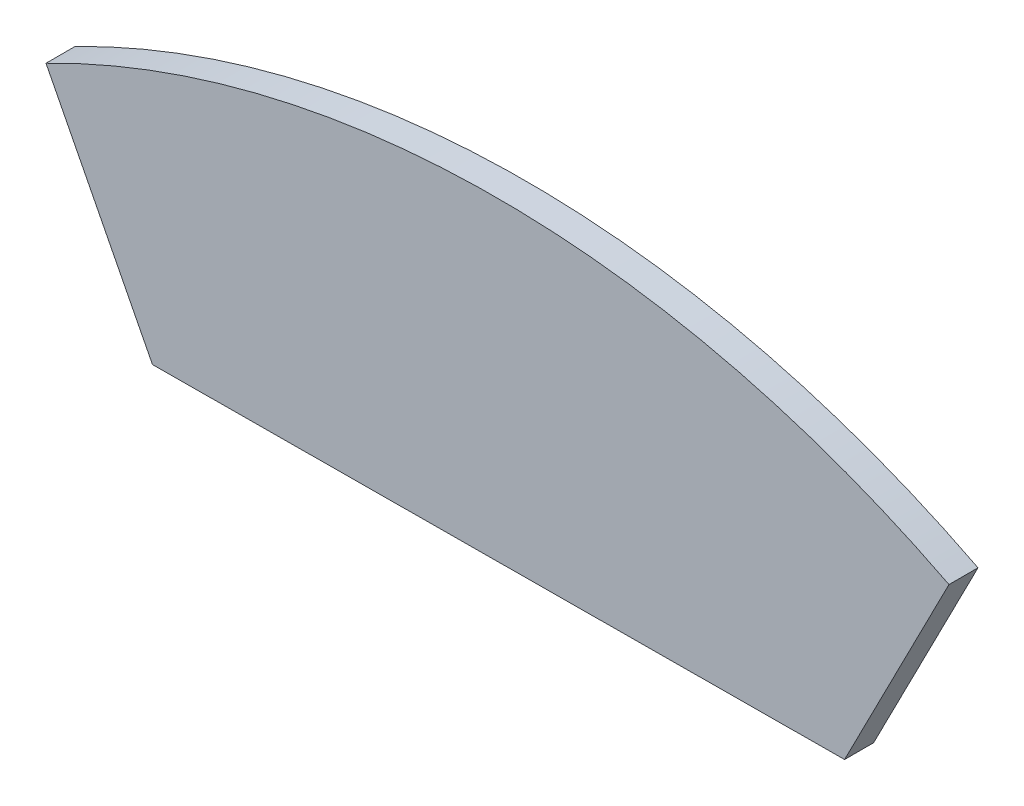
ISO-10303-21;
HEADER;
FILE_DESCRIPTION(('STEP AP214'),'2;1');
FILE_NAME('part.step','',(''),(''),'','','');
FILE_SCHEMA(('AUTOMOTIVE_DESIGN { 1 0 10303 214 1 1 1 1 }'));
ENDSEC;
DATA;
#1=APPLICATION_CONTEXT('core data for automotive mechanical design processes');
#2=APPLICATION_PROTOCOL_DEFINITION('international standard','automotive_design',2000,#1);
#3=PRODUCT_CONTEXT('',#1,'mechanical');
#4=PRODUCT('Part','Part','',(#3));
#5=PRODUCT_RELATED_PRODUCT_CATEGORY('part','',(#4));
#6=PRODUCT_DEFINITION_FORMATION('','',#4);
#7=PRODUCT_DEFINITION_CONTEXT('part definition',#1,'design');
#8=PRODUCT_DEFINITION('design','',#6,#7);
#9=PRODUCT_DEFINITION_SHAPE('','',#8);
#10=(LENGTH_UNIT() NAMED_UNIT(*) SI_UNIT(.MILLI.,.METRE.));
#11=(NAMED_UNIT(*) PLANE_ANGLE_UNIT() SI_UNIT($,.RADIAN.));
#12=(NAMED_UNIT(*) SI_UNIT($,.STERADIAN.) SOLID_ANGLE_UNIT());
#13=UNCERTAINTY_MEASURE_WITH_UNIT(LENGTH_MEASURE(1.E-05),#10,'distance_accuracy_value','');
#14=(GEOMETRIC_REPRESENTATION_CONTEXT(3) GLOBAL_UNCERTAINTY_ASSIGNED_CONTEXT((#13)) GLOBAL_UNIT_ASSIGNED_CONTEXT((#10,
#11,#12)) REPRESENTATION_CONTEXT('',''));
#15=CARTESIAN_POINT('',(0.,0.,0.));
#16=DIRECTION('',(0.,0.,1.));
#17=DIRECTION('',(1.,0.,0.));
#18=AXIS2_PLACEMENT_3D('',#15,#16,#17);
#19=CARTESIAN_POINT('',(0.,0.,3.175));
#20=DIRECTION('',(0.,0.,-1.));
#21=DIRECTION('',(-1.,0.,0.));
#22=AXIS2_PLACEMENT_3D('',#19,#20,#21);
#23=CYLINDRICAL_SURFACE('',#22,108.276621199646);
#24=CARTESIAN_POINT('',(0.,0.,0.));
#25=DIRECTION('',(0.,0.,1.));
#26=DIRECTION('',(1.,0.,0.));
#27=AXIS2_PLACEMENT_3D('',#24,#25,#26);
#28=CIRCLE('',#27,108.276621199646);
#29=CARTESIAN_POINT('',(49.3808428011907,96.3605679863698,0.));
#30=VERTEX_POINT('',#29);
#31=CARTESIAN_POINT('',(-49.3808428011907,96.3605679863698,0.));
#32=VERTEX_POINT('',#31);
#33=EDGE_CURVE('E94',#30,#32,#28,.T.);
#34=ORIENTED_EDGE('',*,*,#33,.T.);
#35=DIRECTION('',(0.,0.,-1.));
#36=VECTOR('',#35,1.);
#37=CARTESIAN_POINT('',(-49.3808428011907,96.3605679863698,3.175));
#38=LINE('',#37,#36);
#39=CARTESIAN_POINT('',(-49.3808428011907,96.3605679863698,3.175));
#40=VERTEX_POINT('',#39);
#41=EDGE_CURVE('E11',#40,#32,#38,.T.);
#42=ORIENTED_EDGE('',*,*,#41,.F.);
#43=CARTESIAN_POINT('',(0.,0.,3.175));
#44=DIRECTION('',(0.,0.,1.));
#45=DIRECTION('',(1.,0.,0.));
#46=AXIS2_PLACEMENT_3D('',#43,#44,#45);
#47=CIRCLE('',#46,108.276621199646);
#48=CARTESIAN_POINT('',(49.3808428011907,96.3605679863698,3.175));
#49=VERTEX_POINT('',#48);
#50=EDGE_CURVE('E82',#49,#40,#47,.T.);
#51=ORIENTED_EDGE('',*,*,#50,.F.);
#52=DIRECTION('',(0.,0.,-1.));
#53=VECTOR('',#52,1.);
#54=CARTESIAN_POINT('',(49.3808428011907,96.3605679863698,3.175));
#55=LINE('',#54,#53);
#56=EDGE_CURVE('E90',#49,#30,#55,.T.);
#57=ORIENTED_EDGE('',*,*,#56,.T.);
#58=EDGE_LOOP('',(#34,#42,#51,#57));
#59=FACE_BOUND('',#58,.T.);
#60=ADVANCED_FACE('F31',(#59),#23,.T.);
#61=CARTESIAN_POINT('',(-49.3808428011907,96.3605679863698,3.175));
#62=DIRECTION('',(0.889948050823408,0.456061911187084,0.));
#63=DIRECTION('',(-0.456061911187084,0.889948050823408,0.));
#64=AXIS2_PLACEMENT_3D('',#61,#62,#63);
#65=PLANE('',#64);
#66=DIRECTION('',(0.456061911187084,-0.889948050823408,0.));
#67=VECTOR('',#66,1.);
#68=CARTESIAN_POINT('',(-49.3808428011907,96.3605679863698,0.));
#69=LINE('',#68,#67);
#70=CARTESIAN_POINT('',(-37.7375822085844,73.6401942488482,0.));
#71=VERTEX_POINT('',#70);
#72=EDGE_CURVE('E86',#32,#71,#69,.T.);
#73=ORIENTED_EDGE('',*,*,#72,.T.);
#74=DIRECTION('',(0.,0.,-1.));
#75=VECTOR('',#74,1.);
#76=CARTESIAN_POINT('',(-37.7375822085844,73.6401942488482,3.175));
#77=LINE('',#76,#75);
#78=CARTESIAN_POINT('',(-37.7375822085844,73.6401942488482,3.175));
#79=VERTEX_POINT('',#78);
#80=EDGE_CURVE('E39',#79,#71,#77,.T.);
#81=ORIENTED_EDGE('',*,*,#80,.F.);
#82=DIRECTION('',(0.456061911187084,-0.889948050823408,0.));
#83=VECTOR('',#82,1.);
#84=CARTESIAN_POINT('',(-49.3808428011907,96.3605679863698,3.175));
#85=LINE('',#84,#83);
#86=EDGE_CURVE('E77',#40,#79,#85,.T.);
#87=ORIENTED_EDGE('',*,*,#86,.F.);
#88=ORIENTED_EDGE('',*,*,#41,.T.);
#89=EDGE_LOOP('',(#73,#81,#87,#88));
#90=FACE_BOUND('',#89,.T.);
#91=ADVANCED_FACE('F85',(#90),#65,.F.);
#92=CARTESIAN_POINT('',(-37.7375822085844,73.6401942488482,3.175));
#93=DIRECTION('',(-0.00576334612766183,0.99998339178279,0.));
#94=DIRECTION('',(-0.99998339178279,-0.00576334612766183,0.));
#95=AXIS2_PLACEMENT_3D('',#92,#93,#94);
#96=PLANE('',#95);
#97=DIRECTION('',(0.99998339178279,0.00576334612766183,0.));
#98=VECTOR('',#97,1.);
#99=CARTESIAN_POINT('',(-37.7375822085844,73.6401942488482,0.));
#100=LINE('',#99,#98);
#101=CARTESIAN_POINT('',(37.9611605493727,74.0764795507122,0.));
#102=VERTEX_POINT('',#101);
#103=EDGE_CURVE('E64',#71,#102,#100,.T.);
#104=ORIENTED_EDGE('',*,*,#103,.T.);
#105=DIRECTION('',(0.,0.,-1.));
#106=VECTOR('',#105,1.);
#107=CARTESIAN_POINT('',(37.9611605493727,74.0764795507122,3.175));
#108=LINE('',#107,#106);
#109=CARTESIAN_POINT('',(37.9611605493727,74.0764795507122,3.175));
#110=VERTEX_POINT('',#109);
#111=EDGE_CURVE('E87',#110,#102,#108,.T.);
#112=ORIENTED_EDGE('',*,*,#111,.F.);
#113=DIRECTION('',(0.99998339178279,0.00576334612766183,0.));
#114=VECTOR('',#113,1.);
#115=CARTESIAN_POINT('',(-37.7375822085844,73.6401942488482,3.175));
#116=LINE('',#115,#114);
#117=EDGE_CURVE('E80',#79,#110,#116,.T.);
#118=ORIENTED_EDGE('',*,*,#117,.F.);
#119=ORIENTED_EDGE('',*,*,#80,.T.);
#120=EDGE_LOOP('',(#104,#112,#118,#119));
#121=FACE_BOUND('',#120,.T.);
#122=ADVANCED_FACE('F88',(#121),#96,.F.);
#123=CARTESIAN_POINT('',(37.9611605493727,74.0764795507122,3.175));
#124=DIRECTION('',(-0.889948050823408,0.456061911187086,0.));
#125=DIRECTION('',(-0.456061911187086,-0.889948050823408,0.));
#126=AXIS2_PLACEMENT_3D('',#123,#124,#125);
#127=PLANE('',#126);
#128=DIRECTION('',(0.456061911187086,0.889948050823408,0.));
#129=VECTOR('',#128,1.);
#130=CARTESIAN_POINT('',(37.9611605493727,74.0764795507122,0.));
#131=LINE('',#130,#129);
#132=EDGE_CURVE('E70',#102,#30,#131,.T.);
#133=ORIENTED_EDGE('',*,*,#132,.T.);
#134=ORIENTED_EDGE('',*,*,#56,.F.);
#135=DIRECTION('',(0.456061911187086,0.889948050823408,0.));
#136=VECTOR('',#135,1.);
#137=CARTESIAN_POINT('',(37.9611605493727,74.0764795507122,3.175));
#138=LINE('',#137,#136);
#139=EDGE_CURVE('E47',#110,#49,#138,.T.);
#140=ORIENTED_EDGE('',*,*,#139,.F.);
#141=ORIENTED_EDGE('',*,*,#111,.T.);
#142=EDGE_LOOP('',(#133,#134,#140,#141));
#143=FACE_BOUND('',#142,.T.);
#144=ADVANCED_FACE('F101',(#143),#127,.F.);
#145=CARTESIAN_POINT('',(0.,0.,3.175));
#146=DIRECTION('',(0.,0.,1.));
#147=DIRECTION('',(1.,0.,0.));
#148=AXIS2_PLACEMENT_3D('',#145,#146,#147);
#149=PLANE('',#148);
#150=ORIENTED_EDGE('',*,*,#50,.T.);
#151=ORIENTED_EDGE('',*,*,#86,.T.);
#152=ORIENTED_EDGE('',*,*,#117,.T.);
#153=ORIENTED_EDGE('',*,*,#139,.T.);
#154=EDGE_LOOP('',(#150,#151,#152,#153));
#155=FACE_BOUND('',#154,.T.);
#156=ADVANCED_FACE('F78',(#155),#149,.T.);
#157=CARTESIAN_POINT('',(0.,0.,0.));
#158=DIRECTION('',(0.,0.,1.));
#159=DIRECTION('',(1.,0.,0.));
#160=AXIS2_PLACEMENT_3D('',#157,#158,#159);
#161=PLANE('',#160);
#162=ORIENTED_EDGE('',*,*,#33,.F.);
#163=ORIENTED_EDGE('',*,*,#132,.F.);
#164=ORIENTED_EDGE('',*,*,#103,.F.);
#165=ORIENTED_EDGE('',*,*,#72,.F.);
#166=EDGE_LOOP('',(#162,#163,#164,#165));
#167=FACE_BOUND('',#166,.T.);
#168=ADVANCED_FACE('F104',(#167),#161,.F.);
#169=CLOSED_SHELL('',(#60,#91,#122,#144,#156,#168));
#170=MANIFOLD_SOLID_BREP('B2',#169);
#171=ADVANCED_BREP_SHAPE_REPRESENTATION('',(#18,#170),#14);
#172=SHAPE_DEFINITION_REPRESENTATION(#9,#171);
ENDSEC;
END-ISO-10303-21;
